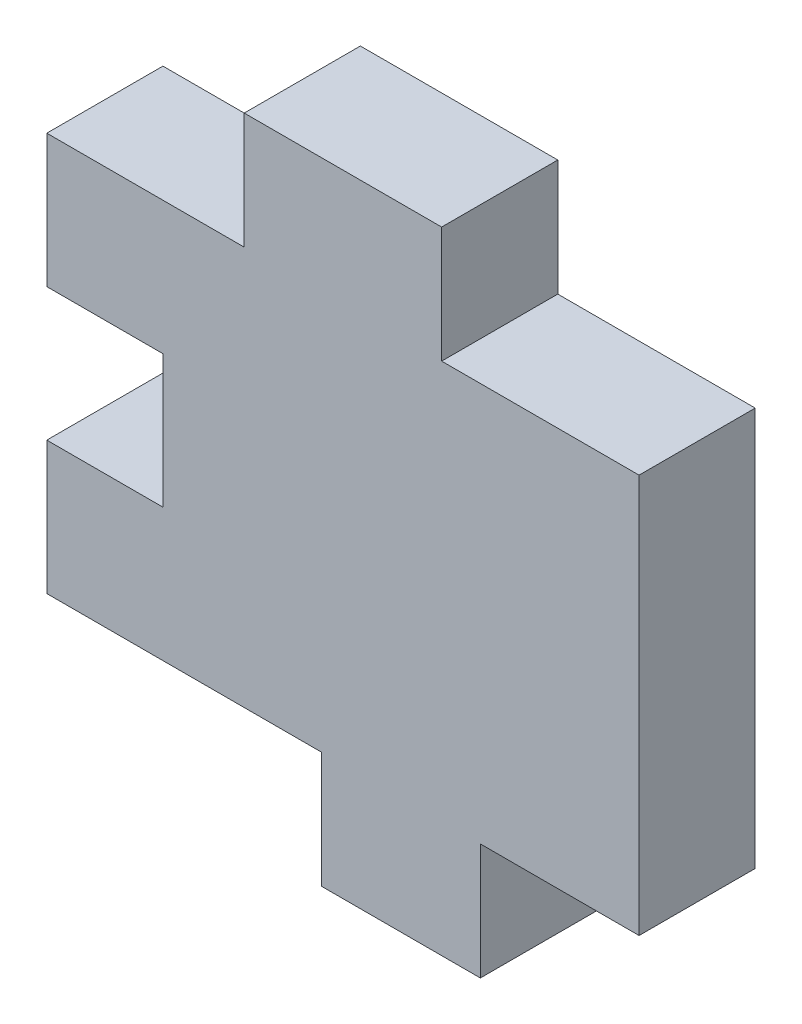
ISO-10303-21;
HEADER;
FILE_DESCRIPTION(('STEP AP214'),'2;1');
FILE_NAME('part.step','',(''),(''),'','','');
FILE_SCHEMA(('AUTOMOTIVE_DESIGN { 1 0 10303 214 1 1 1 1 }'));
ENDSEC;
DATA;
#1=APPLICATION_CONTEXT('core data for automotive mechanical design processes');
#2=APPLICATION_PROTOCOL_DEFINITION('international standard','automotive_design',2000,#1);
#3=PRODUCT_CONTEXT('',#1,'mechanical');
#4=PRODUCT('Part','Part','',(#3));
#5=PRODUCT_RELATED_PRODUCT_CATEGORY('part','',(#4));
#6=PRODUCT_DEFINITION_FORMATION('','',#4);
#7=PRODUCT_DEFINITION_CONTEXT('part definition',#1,'design');
#8=PRODUCT_DEFINITION('design','',#6,#7);
#9=PRODUCT_DEFINITION_SHAPE('','',#8);
#10=(LENGTH_UNIT() NAMED_UNIT(*) SI_UNIT(.MILLI.,.METRE.));
#11=(NAMED_UNIT(*) PLANE_ANGLE_UNIT() SI_UNIT($,.RADIAN.));
#12=(NAMED_UNIT(*) SI_UNIT($,.STERADIAN.) SOLID_ANGLE_UNIT());
#13=UNCERTAINTY_MEASURE_WITH_UNIT(LENGTH_MEASURE(1.E-05),#10,'distance_accuracy_value','');
#14=(GEOMETRIC_REPRESENTATION_CONTEXT(3) GLOBAL_UNCERTAINTY_ASSIGNED_CONTEXT((#13)) GLOBAL_UNIT_ASSIGNED_CONTEXT((#10,
#11,#12)) REPRESENTATION_CONTEXT('',''));
#15=CARTESIAN_POINT('',(0.,0.,0.));
#16=DIRECTION('',(0.,0.,1.));
#17=DIRECTION('',(1.,0.,0.));
#18=AXIS2_PLACEMENT_3D('',#15,#16,#17);
#19=CARTESIAN_POINT('',(0.,0.,3.));
#20=DIRECTION('',(0.,1.,0.));
#21=DIRECTION('',(0.,0.,1.));
#22=AXIS2_PLACEMENT_3D('',#19,#20,#21);
#23=PLANE('',#22);
#24=DIRECTION('',(1.,0.,0.));
#25=VECTOR('',#24,1.);
#26=CARTESIAN_POINT('',(0.,0.,0.));
#27=LINE('',#26,#25);
#28=CARTESIAN_POINT('',(-3.,0.,0.));
#29=VERTEX_POINT('',#28);
#30=CARTESIAN_POINT('',(4.1,0.,0.));
#31=VERTEX_POINT('',#30);
#32=EDGE_CURVE('E116',#29,#31,#27,.T.);
#33=ORIENTED_EDGE('',*,*,#32,.T.);
#34=DIRECTION('',(0.,0.,-1.));
#35=VECTOR('',#34,1.);
#36=CARTESIAN_POINT('',(4.1,0.,3.));
#37=LINE('',#36,#35);
#38=CARTESIAN_POINT('',(4.1,0.,3.));
#39=VERTEX_POINT('',#38);
#40=EDGE_CURVE('E11',#39,#31,#37,.T.);
#41=ORIENTED_EDGE('',*,*,#40,.F.);
#42=DIRECTION('',(1.,0.,0.));
#43=VECTOR('',#42,1.);
#44=CARTESIAN_POINT('',(-3.,0.,3.));
#45=LINE('',#44,#43);
#46=CARTESIAN_POINT('',(-3.,0.,3.));
#47=VERTEX_POINT('',#46);
#48=EDGE_CURVE('E122',#47,#39,#45,.T.);
#49=ORIENTED_EDGE('',*,*,#48,.F.);
#50=DIRECTION('',(0.,0.,-1.));
#51=VECTOR('',#50,1.);
#52=CARTESIAN_POINT('',(-3.,0.,3.));
#53=LINE('',#52,#51);
#54=EDGE_CURVE('E180',#47,#29,#53,.T.);
#55=ORIENTED_EDGE('',*,*,#54,.T.);
#56=EDGE_LOOP('',(#33,#41,#49,#55));
#57=FACE_BOUND('',#56,.T.);
#58=ADVANCED_FACE('F40',(#57),#23,.F.);
#59=CARTESIAN_POINT('',(4.1,0.,3.));
#60=DIRECTION('',(1.,0.,0.));
#61=DIRECTION('',(0.,0.,-1.));
#62=AXIS2_PLACEMENT_3D('',#59,#60,#61);
#63=PLANE('',#62);
#64=DIRECTION('',(0.,-1.,0.));
#65=VECTOR('',#64,1.);
#66=CARTESIAN_POINT('',(4.1,0.,0.));
#67=LINE('',#66,#65);
#68=CARTESIAN_POINT('',(4.1,-3.,0.));
#69=VERTEX_POINT('',#68);
#70=EDGE_CURVE('E185',#31,#69,#67,.T.);
#71=ORIENTED_EDGE('',*,*,#70,.T.);
#72=DIRECTION('',(0.,0.,-1.));
#73=VECTOR('',#72,1.);
#74=CARTESIAN_POINT('',(4.1,-3.,3.));
#75=LINE('',#74,#73);
#76=CARTESIAN_POINT('',(4.1,-3.,3.));
#77=VERTEX_POINT('',#76);
#78=EDGE_CURVE('E48',#77,#69,#75,.T.);
#79=ORIENTED_EDGE('',*,*,#78,.F.);
#80=DIRECTION('',(0.,-1.,0.));
#81=VECTOR('',#80,1.);
#82=CARTESIAN_POINT('',(4.1,0.,3.));
#83=LINE('',#82,#81);
#84=EDGE_CURVE('E302',#39,#77,#83,.T.);
#85=ORIENTED_EDGE('',*,*,#84,.F.);
#86=ORIENTED_EDGE('',*,*,#40,.T.);
#87=EDGE_LOOP('',(#71,#79,#85,#86));
#88=FACE_BOUND('',#87,.T.);
#89=ADVANCED_FACE('F305',(#88),#63,.F.);
#90=CARTESIAN_POINT('',(4.1,-3.,3.));
#91=DIRECTION('',(0.,1.,0.));
#92=DIRECTION('',(-1.,0.,0.));
#93=AXIS2_PLACEMENT_3D('',#90,#91,#92);
#94=PLANE('',#93);
#95=DIRECTION('',(1.,0.,0.));
#96=VECTOR('',#95,1.);
#97=CARTESIAN_POINT('',(4.1,-3.,0.));
#98=LINE('',#97,#96);
#99=CARTESIAN_POINT('',(8.2,-3.,0.));
#100=VERTEX_POINT('',#99);
#101=EDGE_CURVE('E187',#69,#100,#98,.T.);
#102=ORIENTED_EDGE('',*,*,#101,.T.);
#103=DIRECTION('',(0.,0.,-1.));
#104=VECTOR('',#103,1.);
#105=CARTESIAN_POINT('',(8.2,-3.,3.));
#106=LINE('',#105,#104);
#107=CARTESIAN_POINT('',(8.2,-3.,3.));
#108=VERTEX_POINT('',#107);
#109=EDGE_CURVE('E245',#108,#100,#106,.T.);
#110=ORIENTED_EDGE('',*,*,#109,.F.);
#111=DIRECTION('',(1.,0.,0.));
#112=VECTOR('',#111,1.);
#113=CARTESIAN_POINT('',(4.1,-3.,3.));
#114=LINE('',#113,#112);
#115=EDGE_CURVE('E254',#77,#108,#114,.T.);
#116=ORIENTED_EDGE('',*,*,#115,.F.);
#117=ORIENTED_EDGE('',*,*,#78,.T.);
#118=EDGE_LOOP('',(#102,#110,#116,#117));
#119=FACE_BOUND('',#118,.T.);
#120=ADVANCED_FACE('F252',(#119),#94,.F.);
#121=CARTESIAN_POINT('',(8.2,0.,3.));
#122=DIRECTION('',(-1.,0.,0.));
#123=DIRECTION('',(0.,0.,1.));
#124=AXIS2_PLACEMENT_3D('',#121,#122,#123);
#125=PLANE('',#124);
#126=DIRECTION('',(0.,1.,0.));
#127=VECTOR('',#126,1.);
#128=CARTESIAN_POINT('',(8.2,0.,0.));
#129=LINE('',#128,#127);
#130=CARTESIAN_POINT('',(8.2,0.,0.));
#131=VERTEX_POINT('',#130);
#132=EDGE_CURVE('E189',#100,#131,#129,.T.);
#133=ORIENTED_EDGE('',*,*,#132,.T.);
#134=DIRECTION('',(0.,0.,-1.));
#135=VECTOR('',#134,1.);
#136=CARTESIAN_POINT('',(8.2,0.,3.));
#137=LINE('',#136,#135);
#138=CARTESIAN_POINT('',(8.2,0.,3.));
#139=VERTEX_POINT('',#138);
#140=EDGE_CURVE('E242',#139,#131,#137,.T.);
#141=ORIENTED_EDGE('',*,*,#140,.F.);
#142=DIRECTION('',(0.,1.,0.));
#143=VECTOR('',#142,1.);
#144=CARTESIAN_POINT('',(8.2,0.,3.));
#145=LINE('',#144,#143);
#146=EDGE_CURVE('E272',#108,#139,#145,.T.);
#147=ORIENTED_EDGE('',*,*,#146,.F.);
#148=ORIENTED_EDGE('',*,*,#109,.T.);
#149=EDGE_LOOP('',(#133,#141,#147,#148));
#150=FACE_BOUND('',#149,.T.);
#151=ADVANCED_FACE('F263',(#150),#125,.F.);
#152=CARTESIAN_POINT('',(8.2,0.,3.));
#153=DIRECTION('',(0.,1.,0.));
#154=DIRECTION('',(-1.,0.,0.));
#155=AXIS2_PLACEMENT_3D('',#152,#153,#154);
#156=PLANE('',#155);
#157=DIRECTION('',(1.,0.,0.));
#158=VECTOR('',#157,1.);
#159=CARTESIAN_POINT('',(8.2,0.,0.));
#160=LINE('',#159,#158);
#161=CARTESIAN_POINT('',(12.3,0.,0.));
#162=VERTEX_POINT('',#161);
#163=EDGE_CURVE('E191',#131,#162,#160,.T.);
#164=ORIENTED_EDGE('',*,*,#163,.T.);
#165=DIRECTION('',(0.,0.,-1.));
#166=VECTOR('',#165,1.);
#167=CARTESIAN_POINT('',(12.3,0.,3.));
#168=LINE('',#167,#166);
#169=CARTESIAN_POINT('',(12.3,0.,3.));
#170=VERTEX_POINT('',#169);
#171=EDGE_CURVE('E239',#170,#162,#168,.T.);
#172=ORIENTED_EDGE('',*,*,#171,.F.);
#173=DIRECTION('',(1.,0.,0.));
#174=VECTOR('',#173,1.);
#175=CARTESIAN_POINT('',(8.2,0.,3.));
#176=LINE('',#175,#174);
#177=EDGE_CURVE('E269',#139,#170,#176,.T.);
#178=ORIENTED_EDGE('',*,*,#177,.F.);
#179=ORIENTED_EDGE('',*,*,#140,.T.);
#180=EDGE_LOOP('',(#164,#172,#178,#179));
#181=FACE_BOUND('',#180,.T.);
#182=ADVANCED_FACE('F267',(#181),#156,.F.);
#183=CARTESIAN_POINT('',(12.3,0.,3.));
#184=DIRECTION('',(-1.,0.,0.));
#185=DIRECTION('',(0.,-1.,0.));
#186=AXIS2_PLACEMENT_3D('',#183,#184,#185);
#187=PLANE('',#186);
#188=DIRECTION('',(0.,1.,0.));
#189=VECTOR('',#188,1.);
#190=CARTESIAN_POINT('',(12.3,0.,0.));
#191=LINE('',#190,#189);
#192=CARTESIAN_POINT('',(12.3,10.3,0.));
#193=VERTEX_POINT('',#192);
#194=EDGE_CURVE('E193',#162,#193,#191,.T.);
#195=ORIENTED_EDGE('',*,*,#194,.T.);
#196=DIRECTION('',(0.,0.,-1.));
#197=VECTOR('',#196,1.);
#198=CARTESIAN_POINT('',(12.3,10.3,3.));
#199=LINE('',#198,#197);
#200=CARTESIAN_POINT('',(12.3,10.3,3.));
#201=VERTEX_POINT('',#200);
#202=EDGE_CURVE('E236',#201,#193,#199,.T.);
#203=ORIENTED_EDGE('',*,*,#202,.F.);
#204=DIRECTION('',(0.,1.,0.));
#205=VECTOR('',#204,1.);
#206=CARTESIAN_POINT('',(12.3,0.,3.));
#207=LINE('',#206,#205);
#208=EDGE_CURVE('E271',#170,#201,#207,.T.);
#209=ORIENTED_EDGE('',*,*,#208,.F.);
#210=ORIENTED_EDGE('',*,*,#171,.T.);
#211=EDGE_LOOP('',(#195,#203,#209,#210));
#212=FACE_BOUND('',#211,.T.);
#213=ADVANCED_FACE('F317',(#212),#187,.F.);
#214=CARTESIAN_POINT('',(7.2,10.3,3.));
#215=DIRECTION('',(0.,-1.,0.));
#216=DIRECTION('',(0.,0.,-1.));
#217=AXIS2_PLACEMENT_3D('',#214,#215,#216);
#218=PLANE('',#217);
#219=DIRECTION('',(-1.,0.,0.));
#220=VECTOR('',#219,1.);
#221=CARTESIAN_POINT('',(7.2,10.3,0.));
#222=LINE('',#221,#220);
#223=CARTESIAN_POINT('',(7.2,10.3,0.));
#224=VERTEX_POINT('',#223);
#225=EDGE_CURVE('E195',#193,#224,#222,.T.);
#226=ORIENTED_EDGE('',*,*,#225,.T.);
#227=DIRECTION('',(0.,0.,-1.));
#228=VECTOR('',#227,1.);
#229=CARTESIAN_POINT('',(7.2,10.3,3.));
#230=LINE('',#229,#228);
#231=CARTESIAN_POINT('',(7.2,10.3,3.));
#232=VERTEX_POINT('',#231);
#233=EDGE_CURVE('E233',#232,#224,#230,.T.);
#234=ORIENTED_EDGE('',*,*,#233,.F.);
#235=DIRECTION('',(-1.,0.,0.));
#236=VECTOR('',#235,1.);
#237=CARTESIAN_POINT('',(7.2,10.3,3.));
#238=LINE('',#237,#236);
#239=EDGE_CURVE('E274',#201,#232,#238,.T.);
#240=ORIENTED_EDGE('',*,*,#239,.F.);
#241=ORIENTED_EDGE('',*,*,#202,.T.);
#242=EDGE_LOOP('',(#226,#234,#240,#241));
#243=FACE_BOUND('',#242,.T.);
#244=ADVANCED_FACE('F320',(#243),#218,.F.);
#245=CARTESIAN_POINT('',(7.2,13.3,3.));
#246=DIRECTION('',(-1.,0.,0.));
#247=DIRECTION('',(0.,0.,1.));
#248=AXIS2_PLACEMENT_3D('',#245,#246,#247);
#249=PLANE('',#248);
#250=DIRECTION('',(0.,1.,0.));
#251=VECTOR('',#250,1.);
#252=CARTESIAN_POINT('',(7.2,13.3,0.));
#253=LINE('',#252,#251);
#254=CARTESIAN_POINT('',(7.2,13.3,0.));
#255=VERTEX_POINT('',#254);
#256=EDGE_CURVE('E197',#224,#255,#253,.T.);
#257=ORIENTED_EDGE('',*,*,#256,.T.);
#258=DIRECTION('',(0.,0.,-1.));
#259=VECTOR('',#258,1.);
#260=CARTESIAN_POINT('',(7.2,13.3,3.));
#261=LINE('',#260,#259);
#262=CARTESIAN_POINT('',(7.2,13.3,3.));
#263=VERTEX_POINT('',#262);
#264=EDGE_CURVE('E230',#263,#255,#261,.T.);
#265=ORIENTED_EDGE('',*,*,#264,.F.);
#266=DIRECTION('',(0.,1.,0.));
#267=VECTOR('',#266,1.);
#268=CARTESIAN_POINT('',(7.2,13.3,3.));
#269=LINE('',#268,#267);
#270=EDGE_CURVE('E280',#232,#263,#269,.T.);
#271=ORIENTED_EDGE('',*,*,#270,.F.);
#272=ORIENTED_EDGE('',*,*,#233,.T.);
#273=EDGE_LOOP('',(#257,#265,#271,#272));
#274=FACE_BOUND('',#273,.T.);
#275=ADVANCED_FACE('F324',(#274),#249,.F.);
#276=CARTESIAN_POINT('',(2.1,13.3,3.));
#277=DIRECTION('',(0.,-1.,0.));
#278=DIRECTION('',(0.,0.,-1.));
#279=AXIS2_PLACEMENT_3D('',#276,#277,#278);
#280=PLANE('',#279);
#281=DIRECTION('',(-1.,0.,0.));
#282=VECTOR('',#281,1.);
#283=CARTESIAN_POINT('',(2.1,13.3,0.));
#284=LINE('',#283,#282);
#285=CARTESIAN_POINT('',(2.1,13.3,0.));
#286=VERTEX_POINT('',#285);
#287=EDGE_CURVE('E199',#255,#286,#284,.T.);
#288=ORIENTED_EDGE('',*,*,#287,.T.);
#289=DIRECTION('',(0.,0.,-1.));
#290=VECTOR('',#289,1.);
#291=CARTESIAN_POINT('',(2.1,13.3,3.));
#292=LINE('',#291,#290);
#293=CARTESIAN_POINT('',(2.1,13.3,3.));
#294=VERTEX_POINT('',#293);
#295=EDGE_CURVE('E227',#294,#286,#292,.T.);
#296=ORIENTED_EDGE('',*,*,#295,.F.);
#297=DIRECTION('',(-1.,0.,0.));
#298=VECTOR('',#297,1.);
#299=CARTESIAN_POINT('',(2.1,13.3,3.));
#300=LINE('',#299,#298);
#301=EDGE_CURVE('E282',#263,#294,#300,.T.);
#302=ORIENTED_EDGE('',*,*,#301,.F.);
#303=ORIENTED_EDGE('',*,*,#264,.T.);
#304=EDGE_LOOP('',(#288,#296,#302,#303));
#305=FACE_BOUND('',#304,.T.);
#306=ADVANCED_FACE('F328',(#305),#280,.F.);
#307=CARTESIAN_POINT('',(2.1,10.3,3.));
#308=DIRECTION('',(1.,0.,0.));
#309=DIRECTION('',(0.,1.,0.));
#310=AXIS2_PLACEMENT_3D('',#307,#308,#309);
#311=PLANE('',#310);
#312=DIRECTION('',(0.,-1.,0.));
#313=VECTOR('',#312,1.);
#314=CARTESIAN_POINT('',(2.1,10.3,0.));
#315=LINE('',#314,#313);
#316=CARTESIAN_POINT('',(2.1,10.3,0.));
#317=VERTEX_POINT('',#316);
#318=EDGE_CURVE('E201',#286,#317,#315,.T.);
#319=ORIENTED_EDGE('',*,*,#318,.T.);
#320=DIRECTION('',(0.,0.,-1.));
#321=VECTOR('',#320,1.);
#322=CARTESIAN_POINT('',(2.1,10.3,3.));
#323=LINE('',#322,#321);
#324=CARTESIAN_POINT('',(2.1,10.3,3.));
#325=VERTEX_POINT('',#324);
#326=EDGE_CURVE('E224',#325,#317,#323,.T.);
#327=ORIENTED_EDGE('',*,*,#326,.F.);
#328=DIRECTION('',(0.,-1.,0.));
#329=VECTOR('',#328,1.);
#330=CARTESIAN_POINT('',(2.1,10.3,3.));
#331=LINE('',#330,#329);
#332=EDGE_CURVE('E284',#294,#325,#331,.T.);
#333=ORIENTED_EDGE('',*,*,#332,.F.);
#334=ORIENTED_EDGE('',*,*,#295,.T.);
#335=EDGE_LOOP('',(#319,#327,#333,#334));
#336=FACE_BOUND('',#335,.T.);
#337=ADVANCED_FACE('F332',(#336),#311,.F.);
#338=CARTESIAN_POINT('',(0.,10.3,3.));
#339=DIRECTION('',(0.,-1.,0.));
#340=DIRECTION('',(0.,0.,-1.));
#341=AXIS2_PLACEMENT_3D('',#338,#339,#340);
#342=PLANE('',#341);
#343=DIRECTION('',(-1.,0.,0.));
#344=VECTOR('',#343,1.);
#345=CARTESIAN_POINT('',(0.,10.3,0.));
#346=LINE('',#345,#344);
#347=CARTESIAN_POINT('',(-3.,10.3,0.));
#348=VERTEX_POINT('',#347);
#349=EDGE_CURVE('E204',#317,#348,#346,.T.);
#350=ORIENTED_EDGE('',*,*,#349,.T.);
#351=DIRECTION('',(0.,0.,-1.));
#352=VECTOR('',#351,1.);
#353=CARTESIAN_POINT('',(-3.,10.3,3.));
#354=LINE('',#353,#352);
#355=CARTESIAN_POINT('',(-3.,10.3,3.));
#356=VERTEX_POINT('',#355);
#357=EDGE_CURVE('E221',#356,#348,#354,.T.);
#358=ORIENTED_EDGE('',*,*,#357,.F.);
#359=DIRECTION('',(-1.,0.,0.));
#360=VECTOR('',#359,1.);
#361=CARTESIAN_POINT('',(0.,10.3,3.));
#362=LINE('',#361,#360);
#363=EDGE_CURVE('E286',#325,#356,#362,.T.);
#364=ORIENTED_EDGE('',*,*,#363,.F.);
#365=ORIENTED_EDGE('',*,*,#326,.T.);
#366=EDGE_LOOP('',(#350,#358,#364,#365));
#367=FACE_BOUND('',#366,.T.);
#368=ADVANCED_FACE('F336',(#367),#342,.F.);
#369=CARTESIAN_POINT('',(-3.,10.3,3.));
#370=DIRECTION('',(1.,0.,0.));
#371=DIRECTION('',(0.,1.,0.));
#372=AXIS2_PLACEMENT_3D('',#369,#370,#371);
#373=PLANE('',#372);
#374=DIRECTION('',(0.,-1.,0.));
#375=VECTOR('',#374,1.);
#376=CARTESIAN_POINT('',(-3.,10.3,0.));
#377=LINE('',#376,#375);
#378=CARTESIAN_POINT('',(-3.,6.86666666666667,0.));
#379=VERTEX_POINT('',#378);
#380=EDGE_CURVE('E206',#348,#379,#377,.T.);
#381=ORIENTED_EDGE('',*,*,#380,.T.);
#382=DIRECTION('',(0.,0.,-1.));
#383=VECTOR('',#382,1.);
#384=CARTESIAN_POINT('',(-3.,6.86666666666667,3.));
#385=LINE('',#384,#383);
#386=CARTESIAN_POINT('',(-3.,6.86666666666667,3.));
#387=VERTEX_POINT('',#386);
#388=EDGE_CURVE('E218',#387,#379,#385,.T.);
#389=ORIENTED_EDGE('',*,*,#388,.F.);
#390=DIRECTION('',(0.,-1.,0.));
#391=VECTOR('',#390,1.);
#392=CARTESIAN_POINT('',(-3.,10.3,3.));
#393=LINE('',#392,#391);
#394=EDGE_CURVE('E288',#356,#387,#393,.T.);
#395=ORIENTED_EDGE('',*,*,#394,.F.);
#396=ORIENTED_EDGE('',*,*,#357,.T.);
#397=EDGE_LOOP('',(#381,#389,#395,#396));
#398=FACE_BOUND('',#397,.T.);
#399=ADVANCED_FACE('F294',(#398),#373,.F.);
#400=CARTESIAN_POINT('',(-3.,6.86666666666667,3.));
#401=DIRECTION('',(0.,1.,0.));
#402=DIRECTION('',(0.,0.,1.));
#403=AXIS2_PLACEMENT_3D('',#400,#401,#402);
#404=PLANE('',#403);
#405=DIRECTION('',(1.,0.,0.));
#406=VECTOR('',#405,1.);
#407=CARTESIAN_POINT('',(-3.,6.86666666666667,0.));
#408=LINE('',#407,#406);
#409=CARTESIAN_POINT('',(0.,6.86666666666667,0.));
#410=VERTEX_POINT('',#409);
#411=EDGE_CURVE('E208',#379,#410,#408,.T.);
#412=ORIENTED_EDGE('',*,*,#411,.T.);
#413=DIRECTION('',(0.,0.,-1.));
#414=VECTOR('',#413,1.);
#415=CARTESIAN_POINT('',(0.,6.86666666666667,3.));
#416=LINE('',#415,#414);
#417=CARTESIAN_POINT('',(0.,6.86666666666667,3.));
#418=VERTEX_POINT('',#417);
#419=EDGE_CURVE('E175',#418,#410,#416,.T.);
#420=ORIENTED_EDGE('',*,*,#419,.F.);
#421=DIRECTION('',(1.,0.,0.));
#422=VECTOR('',#421,1.);
#423=CARTESIAN_POINT('',(-3.,6.86666666666667,3.));
#424=LINE('',#423,#422);
#425=EDGE_CURVE('E166',#387,#418,#424,.T.);
#426=ORIENTED_EDGE('',*,*,#425,.F.);
#427=ORIENTED_EDGE('',*,*,#388,.T.);
#428=EDGE_LOOP('',(#412,#420,#426,#427));
#429=FACE_BOUND('',#428,.T.);
#430=ADVANCED_FACE('F298',(#429),#404,.F.);
#431=CARTESIAN_POINT('',(0.,6.86666666666667,3.));
#432=DIRECTION('',(1.,0.,0.));
#433=DIRECTION('',(0.,1.,0.));
#434=AXIS2_PLACEMENT_3D('',#431,#432,#433);
#435=PLANE('',#434);
#436=DIRECTION('',(0.,-1.,0.));
#437=VECTOR('',#436,1.);
#438=CARTESIAN_POINT('',(0.,6.86666666666667,0.));
#439=LINE('',#438,#437);
#440=CARTESIAN_POINT('',(0.,3.43333333333333,0.));
#441=VERTEX_POINT('',#440);
#442=EDGE_CURVE('E174',#410,#441,#439,.T.);
#443=ORIENTED_EDGE('',*,*,#442,.T.);
#444=DIRECTION('',(0.,0.,-1.));
#445=VECTOR('',#444,1.);
#446=CARTESIAN_POINT('',(0.,3.43333333333333,3.));
#447=LINE('',#446,#445);
#448=CARTESIAN_POINT('',(0.,3.43333333333333,3.));
#449=VERTEX_POINT('',#448);
#450=EDGE_CURVE('E171',#449,#441,#447,.T.);
#451=ORIENTED_EDGE('',*,*,#450,.F.);
#452=DIRECTION('',(0.,-1.,0.));
#453=VECTOR('',#452,1.);
#454=CARTESIAN_POINT('',(0.,6.86666666666667,3.));
#455=LINE('',#454,#453);
#456=EDGE_CURVE('E160',#418,#449,#455,.T.);
#457=ORIENTED_EDGE('',*,*,#456,.F.);
#458=ORIENTED_EDGE('',*,*,#419,.T.);
#459=EDGE_LOOP('',(#443,#451,#457,#458));
#460=FACE_BOUND('',#459,.T.);
#461=ADVANCED_FACE('F172',(#460),#435,.F.);
#462=CARTESIAN_POINT('',(0.,3.43333333333333,3.));
#463=DIRECTION('',(0.,-1.,0.));
#464=DIRECTION('',(1.,0.,0.));
#465=AXIS2_PLACEMENT_3D('',#462,#463,#464);
#466=PLANE('',#465);
#467=DIRECTION('',(-1.,0.,0.));
#468=VECTOR('',#467,1.);
#469=CARTESIAN_POINT('',(0.,3.43333333333333,0.));
#470=LINE('',#469,#468);
#471=CARTESIAN_POINT('',(-3.,3.43333333333333,0.));
#472=VERTEX_POINT('',#471);
#473=EDGE_CURVE('E109',#441,#472,#470,.T.);
#474=ORIENTED_EDGE('',*,*,#473,.T.);
#475=DIRECTION('',(0.,0.,-1.));
#476=VECTOR('',#475,1.);
#477=CARTESIAN_POINT('',(-3.,3.43333333333333,3.));
#478=LINE('',#477,#476);
#479=CARTESIAN_POINT('',(-3.,3.43333333333333,3.));
#480=VERTEX_POINT('',#479);
#481=EDGE_CURVE('E176',#480,#472,#478,.T.);
#482=ORIENTED_EDGE('',*,*,#481,.F.);
#483=DIRECTION('',(-1.,0.,0.));
#484=VECTOR('',#483,1.);
#485=CARTESIAN_POINT('',(0.,3.43333333333333,3.));
#486=LINE('',#485,#484);
#487=EDGE_CURVE('E164',#449,#480,#486,.T.);
#488=ORIENTED_EDGE('',*,*,#487,.F.);
#489=ORIENTED_EDGE('',*,*,#450,.T.);
#490=EDGE_LOOP('',(#474,#482,#488,#489));
#491=FACE_BOUND('',#490,.T.);
#492=ADVANCED_FACE('F178',(#491),#466,.F.);
#493=CARTESIAN_POINT('',(-3.,3.43333333333333,3.));
#494=DIRECTION('',(1.,0.,0.));
#495=DIRECTION('',(0.,1.,0.));
#496=AXIS2_PLACEMENT_3D('',#493,#494,#495);
#497=PLANE('',#496);
#498=DIRECTION('',(0.,-1.,0.));
#499=VECTOR('',#498,1.);
#500=CARTESIAN_POINT('',(-3.,3.43333333333333,0.));
#501=LINE('',#500,#499);
#502=EDGE_CURVE('E212',#472,#29,#501,.T.);
#503=ORIENTED_EDGE('',*,*,#502,.T.);
#504=ORIENTED_EDGE('',*,*,#54,.F.);
#505=DIRECTION('',(0.,-1.,0.));
#506=VECTOR('',#505,1.);
#507=CARTESIAN_POINT('',(-3.,3.43333333333333,3.));
#508=LINE('',#507,#506);
#509=EDGE_CURVE('E56',#480,#47,#508,.T.);
#510=ORIENTED_EDGE('',*,*,#509,.F.);
#511=ORIENTED_EDGE('',*,*,#481,.T.);
#512=EDGE_LOOP('',(#503,#504,#510,#511));
#513=FACE_BOUND('',#512,.T.);
#514=ADVANCED_FACE('F300',(#513),#497,.F.);
#515=CARTESIAN_POINT('',(0.,0.,3.));
#516=DIRECTION('',(0.,0.,-1.));
#517=DIRECTION('',(-1.,0.,0.));
#518=AXIS2_PLACEMENT_3D('',#515,#516,#517);
#519=PLANE('',#518);
#520=ORIENTED_EDGE('',*,*,#48,.T.);
#521=ORIENTED_EDGE('',*,*,#84,.T.);
#522=ORIENTED_EDGE('',*,*,#115,.T.);
#523=ORIENTED_EDGE('',*,*,#146,.T.);
#524=ORIENTED_EDGE('',*,*,#177,.T.);
#525=ORIENTED_EDGE('',*,*,#208,.T.);
#526=ORIENTED_EDGE('',*,*,#239,.T.);
#527=ORIENTED_EDGE('',*,*,#270,.T.);
#528=ORIENTED_EDGE('',*,*,#301,.T.);
#529=ORIENTED_EDGE('',*,*,#332,.T.);
#530=ORIENTED_EDGE('',*,*,#363,.T.);
#531=ORIENTED_EDGE('',*,*,#394,.T.);
#532=ORIENTED_EDGE('',*,*,#425,.T.);
#533=ORIENTED_EDGE('',*,*,#456,.T.);
#534=ORIENTED_EDGE('',*,*,#487,.T.);
#535=ORIENTED_EDGE('',*,*,#509,.T.);
#536=EDGE_LOOP('',(#520,#521,#522,#523,#524,#525,#526,#527,#528,#529,#530,#531,#532,#533,#534,#535));
#537=FACE_BOUND('',#536,.T.);
#538=ADVANCED_FACE('F162',(#537),#519,.F.);
#539=CARTESIAN_POINT('',(0.,0.,0.));
#540=DIRECTION('',(0.,0.,-1.));
#541=DIRECTION('',(-1.,0.,0.));
#542=AXIS2_PLACEMENT_3D('',#539,#540,#541);
#543=PLANE('',#542);
#544=ORIENTED_EDGE('',*,*,#32,.F.);
#545=ORIENTED_EDGE('',*,*,#502,.F.);
#546=ORIENTED_EDGE('',*,*,#473,.F.);
#547=ORIENTED_EDGE('',*,*,#442,.F.);
#548=ORIENTED_EDGE('',*,*,#411,.F.);
#549=ORIENTED_EDGE('',*,*,#380,.F.);
#550=ORIENTED_EDGE('',*,*,#349,.F.);
#551=ORIENTED_EDGE('',*,*,#318,.F.);
#552=ORIENTED_EDGE('',*,*,#287,.F.);
#553=ORIENTED_EDGE('',*,*,#256,.F.);
#554=ORIENTED_EDGE('',*,*,#225,.F.);
#555=ORIENTED_EDGE('',*,*,#194,.F.);
#556=ORIENTED_EDGE('',*,*,#163,.F.);
#557=ORIENTED_EDGE('',*,*,#132,.F.);
#558=ORIENTED_EDGE('',*,*,#101,.F.);
#559=ORIENTED_EDGE('',*,*,#70,.F.);
#560=EDGE_LOOP('',(#544,#545,#546,#547,#548,#549,#550,#551,#552,#553,#554,#555,#556,#557,#558,#559));
#561=FACE_BOUND('',#560,.T.);
#562=ADVANCED_FACE('F258',(#561),#543,.T.);
#563=CLOSED_SHELL('',(#58,#89,#120,#151,#182,#213,#244,#275,#306,#337,#368,#399,#430,#461,#492,
#514,#538,#562));
#564=MANIFOLD_SOLID_BREP('B2',#563);
#565=ADVANCED_BREP_SHAPE_REPRESENTATION('',(#18,#564),#14);
#566=SHAPE_DEFINITION_REPRESENTATION(#9,#565);
ENDSEC;
END-ISO-10303-21;
